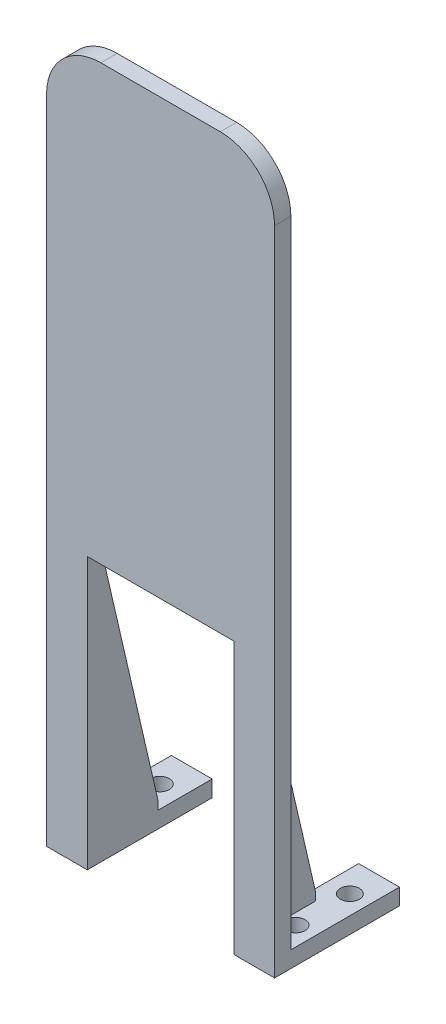
ISO-10303-21;
HEADER;
FILE_DESCRIPTION(('STEP AP214'),'2;1');
FILE_NAME('part.step','',(''),(''),'','','');
FILE_SCHEMA(('AUTOMOTIVE_DESIGN { 1 0 10303 214 1 1 1 1 }'));
ENDSEC;
DATA;
#1=APPLICATION_CONTEXT('core data for automotive mechanical design processes');
#2=APPLICATION_PROTOCOL_DEFINITION('international standard','automotive_design',2000,#1);
#3=PRODUCT_CONTEXT('',#1,'mechanical');
#4=PRODUCT('Part','Part','',(#3));
#5=PRODUCT_RELATED_PRODUCT_CATEGORY('part','',(#4));
#6=PRODUCT_DEFINITION_FORMATION('','',#4);
#7=PRODUCT_DEFINITION_CONTEXT('part definition',#1,'design');
#8=PRODUCT_DEFINITION('design','',#6,#7);
#9=PRODUCT_DEFINITION_SHAPE('','',#8);
#10=(LENGTH_UNIT() NAMED_UNIT(*) SI_UNIT(.MILLI.,.METRE.));
#11=(NAMED_UNIT(*) PLANE_ANGLE_UNIT() SI_UNIT($,.RADIAN.));
#12=(NAMED_UNIT(*) SI_UNIT($,.STERADIAN.) SOLID_ANGLE_UNIT());
#13=UNCERTAINTY_MEASURE_WITH_UNIT(LENGTH_MEASURE(1.E-05),#10,'distance_accuracy_value','');
#14=(GEOMETRIC_REPRESENTATION_CONTEXT(3) GLOBAL_UNCERTAINTY_ASSIGNED_CONTEXT((#13)) GLOBAL_UNIT_ASSIGNED_CONTEXT((#10,
#11,#12)) REPRESENTATION_CONTEXT('',''));
#15=CARTESIAN_POINT('',(0.,0.,0.));
#16=DIRECTION('',(0.,0.,1.));
#17=DIRECTION('',(1.,0.,0.));
#18=AXIS2_PLACEMENT_3D('',#15,#16,#17);
#19=CARTESIAN_POINT('',(0.,0.,-10.));
#20=DIRECTION('',(0.,0.,1.));
#21=DIRECTION('',(1.,0.,0.));
#22=AXIS2_PLACEMENT_3D('',#19,#20,#21);
#23=PLANE('',#22);
#24=DIRECTION('',(1.,0.,0.));
#25=VECTOR('',#24,1.);
#26=CARTESIAN_POINT('',(13.5,-62.,-10.));
#27=LINE('',#26,#25);
#28=CARTESIAN_POINT('',(13.5,-62.,-10.));
#29=VERTEX_POINT('',#28);
#30=CARTESIAN_POINT('',(15.5,-62.,-10.));
#31=VERTEX_POINT('',#30);
#32=EDGE_CURVE('E215',#29,#31,#27,.T.);
#33=ORIENTED_EDGE('',*,*,#32,.F.);
#34=DIRECTION('',(0.,1.,0.));
#35=VECTOR('',#34,1.);
#36=CARTESIAN_POINT('',(13.5,-65.,-10.));
#37=LINE('',#36,#35);
#38=CARTESIAN_POINT('',(13.5,-60.3147587428414,-10.));
#39=VERTEX_POINT('',#38);
#40=EDGE_CURVE('E288',#29,#39,#37,.T.);
#41=ORIENTED_EDGE('',*,*,#40,.T.);
#42=DIRECTION('',(1.,0.,0.));
#43=VECTOR('',#42,1.);
#44=CARTESIAN_POINT('',(0.,-60.3147587428414,-10.));
#45=LINE('',#44,#43);
#46=CARTESIAN_POINT('',(15.5,-60.3147587428414,-10.));
#47=VERTEX_POINT('',#46);
#48=EDGE_CURVE('E381',#39,#47,#45,.T.);
#49=ORIENTED_EDGE('',*,*,#48,.T.);
#50=DIRECTION('',(0.,-1.,0.));
#51=VECTOR('',#50,1.);
#52=CARTESIAN_POINT('',(15.5,-62.,-10.));
#53=LINE('',#52,#51);
#54=EDGE_CURVE('E291',#47,#31,#53,.T.);
#55=ORIENTED_EDGE('',*,*,#54,.T.);
#56=EDGE_LOOP('',(#33,#41,#49,#55));
#57=FACE_BOUND('',#56,.T.);
#58=ADVANCED_FACE('F45',(#57),#23,.F.);
#59=CARTESIAN_POINT('',(0.,0.,-10.));
#60=DIRECTION('',(0.,0.,1.));
#61=DIRECTION('',(1.,0.,0.));
#62=AXIS2_PLACEMENT_3D('',#59,#60,#61);
#63=PLANE('',#62);
#64=DIRECTION('',(1.,0.,0.));
#65=VECTOR('',#64,1.);
#66=CARTESIAN_POINT('',(-21.,-62.,-10.));
#67=LINE('',#66,#65);
#68=CARTESIAN_POINT('',(-15.5,-62.,-10.));
#69=VERTEX_POINT('',#68);
#70=CARTESIAN_POINT('',(-13.5,-62.,-10.));
#71=VERTEX_POINT('',#70);
#72=EDGE_CURVE('E241',#69,#71,#67,.T.);
#73=ORIENTED_EDGE('',*,*,#72,.F.);
#74=DIRECTION('',(0.,1.,0.));
#75=VECTOR('',#74,1.);
#76=CARTESIAN_POINT('',(-15.5,-62.,-10.));
#77=LINE('',#76,#75);
#78=CARTESIAN_POINT('',(-15.5,-60.3147587428414,-10.));
#79=VERTEX_POINT('',#78);
#80=EDGE_CURVE('E268',#69,#79,#77,.T.);
#81=ORIENTED_EDGE('',*,*,#80,.T.);
#82=DIRECTION('',(1.,0.,0.));
#83=VECTOR('',#82,1.);
#84=CARTESIAN_POINT('',(0.,-60.3147587428414,-10.));
#85=LINE('',#84,#83);
#86=CARTESIAN_POINT('',(-13.5,-60.3147587428414,-10.));
#87=VERTEX_POINT('',#86);
#88=EDGE_CURVE('E371',#79,#87,#85,.T.);
#89=ORIENTED_EDGE('',*,*,#88,.T.);
#90=DIRECTION('',(0.,-1.,0.));
#91=VECTOR('',#90,1.);
#92=CARTESIAN_POINT('',(-13.5,-65.,-10.));
#93=LINE('',#92,#91);
#94=EDGE_CURVE('E274',#87,#71,#93,.T.);
#95=ORIENTED_EDGE('',*,*,#94,.T.);
#96=EDGE_LOOP('',(#73,#81,#89,#95));
#97=FACE_BOUND('',#96,.T.);
#98=ADVANCED_FACE('F473',(#97),#63,.F.);
#99=CARTESIAN_POINT('',(0.,0.,0.));
#100=DIRECTION('',(0.,0.,1.));
#101=DIRECTION('',(1.,0.,0.));
#102=AXIS2_PLACEMENT_3D('',#99,#100,#101);
#103=PLANE('',#102);
#104=DIRECTION('',(0.,-1.,0.));
#105=VECTOR('',#104,1.);
#106=CARTESIAN_POINT('',(-21.,65.,0.));
#107=LINE('',#106,#105);
#108=CARTESIAN_POINT('',(-21.,55.,0.));
#109=VERTEX_POINT('',#108);
#110=CARTESIAN_POINT('',(-21.,-62.,0.));
#111=VERTEX_POINT('',#110);
#112=EDGE_CURVE('E345',#109,#111,#107,.T.);
#113=ORIENTED_EDGE('',*,*,#112,.F.);
#114=CARTESIAN_POINT('',(-11.,55.,0.));
#115=DIRECTION('',(0.,0.,1.));
#116=DIRECTION('',(1.,0.,0.));
#117=AXIS2_PLACEMENT_3D('',#114,#115,#116);
#118=CIRCLE('',#117,10.);
#119=CARTESIAN_POINT('',(-11.,65.,0.));
#120=VERTEX_POINT('',#119);
#121=EDGE_CURVE('E412',#109,#120,#118,.F.);
#122=ORIENTED_EDGE('',*,*,#121,.T.);
#123=DIRECTION('',(-1.,0.,0.));
#124=VECTOR('',#123,1.);
#125=CARTESIAN_POINT('',(-21.,65.,0.));
#126=LINE('',#125,#124);
#127=CARTESIAN_POINT('',(11.,65.,0.));
#128=VERTEX_POINT('',#127);
#129=EDGE_CURVE('E358',#128,#120,#126,.T.);
#130=ORIENTED_EDGE('',*,*,#129,.F.);
#131=CARTESIAN_POINT('',(11.,55.,0.));
#132=DIRECTION('',(0.,0.,1.));
#133=DIRECTION('',(1.,0.,0.));
#134=AXIS2_PLACEMENT_3D('',#131,#132,#133);
#135=CIRCLE('',#134,10.);
#136=CARTESIAN_POINT('',(21.,55.,0.));
#137=VERTEX_POINT('',#136);
#138=EDGE_CURVE('E409',#128,#137,#135,.F.);
#139=ORIENTED_EDGE('',*,*,#138,.T.);
#140=DIRECTION('',(0.,1.,0.));
#141=VECTOR('',#140,1.);
#142=CARTESIAN_POINT('',(21.,65.,0.));
#143=LINE('',#142,#141);
#144=CARTESIAN_POINT('',(21.,-62.,0.));
#145=VERTEX_POINT('',#144);
#146=EDGE_CURVE('E195',#145,#137,#143,.T.);
#147=ORIENTED_EDGE('',*,*,#146,.F.);
#148=DIRECTION('',(1.,0.,0.));
#149=VECTOR('',#148,1.);
#150=CARTESIAN_POINT('',(21.,-62.,0.));
#151=LINE('',#150,#149);
#152=CARTESIAN_POINT('',(15.5,-62.,0.));
#153=VERTEX_POINT('',#152);
#154=EDGE_CURVE('E292',#153,#145,#151,.T.);
#155=ORIENTED_EDGE('',*,*,#154,.F.);
#156=DIRECTION('',(0.,-1.,0.));
#157=VECTOR('',#156,1.);
#158=CARTESIAN_POINT('',(15.5,-62.,0.));
#159=LINE('',#158,#157);
#160=CARTESIAN_POINT('',(15.5,-17.,0.));
#161=VERTEX_POINT('',#160);
#162=EDGE_CURVE('E299',#161,#153,#159,.T.);
#163=ORIENTED_EDGE('',*,*,#162,.F.);
#164=DIRECTION('',(1.,0.,0.));
#165=VECTOR('',#164,1.);
#166=CARTESIAN_POINT('',(13.5,-17.,0.));
#167=LINE('',#166,#165);
#168=CARTESIAN_POINT('',(13.5,-17.,0.));
#169=VERTEX_POINT('',#168);
#170=EDGE_CURVE('E282',#169,#161,#167,.T.);
#171=ORIENTED_EDGE('',*,*,#170,.F.);
#172=DIRECTION('',(0.,1.,0.));
#173=VECTOR('',#172,1.);
#174=CARTESIAN_POINT('',(13.5,0.,0.));
#175=LINE('',#174,#173);
#176=CARTESIAN_POINT('',(13.5,-15.,0.));
#177=VERTEX_POINT('',#176);
#178=EDGE_CURVE('E368',#169,#177,#175,.T.);
#179=ORIENTED_EDGE('',*,*,#178,.T.);
#180=DIRECTION('',(-1.,0.,0.));
#181=VECTOR('',#180,1.);
#182=CARTESIAN_POINT('',(-13.5,-15.,0.));
#183=LINE('',#182,#181);
#184=CARTESIAN_POINT('',(-13.5,-15.,0.));
#185=VERTEX_POINT('',#184);
#186=EDGE_CURVE('E314',#177,#185,#183,.T.);
#187=ORIENTED_EDGE('',*,*,#186,.T.);
#188=DIRECTION('',(0.,-1.,0.));
#189=VECTOR('',#188,1.);
#190=CARTESIAN_POINT('',(-13.5,-115.,0.));
#191=LINE('',#190,#189);
#192=CARTESIAN_POINT('',(-13.5,-17.,0.));
#193=VERTEX_POINT('',#192);
#194=EDGE_CURVE('E318',#185,#193,#191,.T.);
#195=ORIENTED_EDGE('',*,*,#194,.T.);
#196=DIRECTION('',(1.,0.,0.));
#197=VECTOR('',#196,1.);
#198=CARTESIAN_POINT('',(-13.5,-17.,0.));
#199=LINE('',#198,#197);
#200=CARTESIAN_POINT('',(-15.5,-17.,0.));
#201=VERTEX_POINT('',#200);
#202=EDGE_CURVE('E269',#201,#193,#199,.T.);
#203=ORIENTED_EDGE('',*,*,#202,.F.);
#204=DIRECTION('',(0.,1.,0.));
#205=VECTOR('',#204,1.);
#206=CARTESIAN_POINT('',(-15.5,-62.,0.));
#207=LINE('',#206,#205);
#208=CARTESIAN_POINT('',(-15.5,-62.,0.));
#209=VERTEX_POINT('',#208);
#210=EDGE_CURVE('E273',#209,#201,#207,.T.);
#211=ORIENTED_EDGE('',*,*,#210,.F.);
#212=DIRECTION('',(1.,0.,0.));
#213=VECTOR('',#212,1.);
#214=CARTESIAN_POINT('',(-15.5,-62.,0.));
#215=LINE('',#214,#213);
#216=EDGE_CURVE('E278',#111,#209,#215,.T.);
#217=ORIENTED_EDGE('',*,*,#216,.F.);
#218=EDGE_LOOP('',(#113,#122,#130,#139,#147,#155,#163,#171,#179,#187,#195,#203,#211,#217));
#219=FACE_BOUND('',#218,.T.);
#220=ADVANCED_FACE('F439',(#219),#103,.F.);
#221=CARTESIAN_POINT('',(-21.,-65.,3.));
#222=DIRECTION('',(0.,1.,0.));
#223=DIRECTION('',(0.,0.,1.));
#224=AXIS2_PLACEMENT_3D('',#221,#222,#223);
#225=PLANE('',#224);
#226=CARTESIAN_POINT('',(17.5,-65.,-14.3685969401071));
#227=DIRECTION('',(0.,-1.,0.));
#228=DIRECTION('',(0.,0.,-1.));
#229=AXIS2_PLACEMENT_3D('',#226,#227,#228);
#230=CIRCLE('',#229,1.75);
#231=CARTESIAN_POINT('',(17.5,-65.,-16.1185969401071));
#232=VERTEX_POINT('',#231);
#233=EDGE_CURVE('E827',#232,#232,#230,.T.);
#234=ORIENTED_EDGE('',*,*,#233,.F.);
#235=EDGE_LOOP('',(#234));
#236=FACE_BOUND('',#235,.T.);
#237=CARTESIAN_POINT('',(17.5,-65.,-4.36859694010711));
#238=DIRECTION('',(0.,-1.,0.));
#239=DIRECTION('',(0.,0.,-1.));
#240=AXIS2_PLACEMENT_3D('',#237,#238,#239);
#241=CIRCLE('',#240,1.75);
#242=CARTESIAN_POINT('',(17.5,-65.,-6.11859694010711));
#243=VERTEX_POINT('',#242);
#244=EDGE_CURVE('E250',#243,#243,#241,.T.);
#245=ORIENTED_EDGE('',*,*,#244,.F.);
#246=EDGE_LOOP('',(#245));
#247=FACE_BOUND('',#246,.T.);
#248=DIRECTION('',(1.,0.,0.));
#249=VECTOR('',#248,1.);
#250=CARTESIAN_POINT('',(-21.,-65.,3.));
#251=LINE('',#250,#249);
#252=CARTESIAN_POINT('',(13.5,-65.,3.));
#253=VERTEX_POINT('',#252);
#254=CARTESIAN_POINT('',(21.,-65.,3.));
#255=VERTEX_POINT('',#254);
#256=EDGE_CURVE('E190',#253,#255,#251,.T.);
#257=ORIENTED_EDGE('',*,*,#256,.F.);
#258=DIRECTION('',(0.,0.,-1.));
#259=VECTOR('',#258,1.);
#260=CARTESIAN_POINT('',(13.5,-65.,3.));
#261=LINE('',#260,#259);
#262=CARTESIAN_POINT('',(13.5,-65.,-20.));
#263=VERTEX_POINT('',#262);
#264=EDGE_CURVE('E185',#253,#263,#261,.T.);
#265=ORIENTED_EDGE('',*,*,#264,.T.);
#266=DIRECTION('',(-1.,0.,0.));
#267=VECTOR('',#266,1.);
#268=CARTESIAN_POINT('',(13.5,-65.,-20.));
#269=LINE('',#268,#267);
#270=CARTESIAN_POINT('',(21.,-65.,-20.));
#271=VERTEX_POINT('',#270);
#272=EDGE_CURVE('E189',#271,#263,#269,.T.);
#273=ORIENTED_EDGE('',*,*,#272,.F.);
#274=DIRECTION('',(0.,0.,-1.));
#275=VECTOR('',#274,1.);
#276=CARTESIAN_POINT('',(21.,-65.,3.));
#277=LINE('',#276,#275);
#278=EDGE_CURVE('E355',#255,#271,#277,.T.);
#279=ORIENTED_EDGE('',*,*,#278,.F.);
#280=EDGE_LOOP('',(#257,#265,#273,#279));
#281=FACE_BOUND('',#280,.T.);
#282=ADVANCED_FACE('F187',(#236,#247,#281),#225,.F.);
#283=CARTESIAN_POINT('',(21.,65.,3.));
#284=DIRECTION('',(-1.,0.,0.));
#285=DIRECTION('',(0.,-1.,0.));
#286=AXIS2_PLACEMENT_3D('',#283,#284,#285);
#287=PLANE('',#286);
#288=ORIENTED_EDGE('',*,*,#146,.T.);
#289=DIRECTION('',(0.,0.,-1.));
#290=VECTOR('',#289,1.);
#291=CARTESIAN_POINT('',(21.,55.,3.));
#292=LINE('',#291,#290);
#293=CARTESIAN_POINT('',(21.,55.,3.));
#294=VERTEX_POINT('',#293);
#295=EDGE_CURVE('E11',#137,#294,#292,.F.);
#296=ORIENTED_EDGE('',*,*,#295,.T.);
#297=DIRECTION('',(0.,1.,0.));
#298=VECTOR('',#297,1.);
#299=CARTESIAN_POINT('',(21.,65.,3.));
#300=LINE('',#299,#298);
#301=EDGE_CURVE('E341',#255,#294,#300,.T.);
#302=ORIENTED_EDGE('',*,*,#301,.F.);
#303=ORIENTED_EDGE('',*,*,#278,.T.);
#304=DIRECTION('',(0.,-1.,0.));
#305=VECTOR('',#304,1.);
#306=CARTESIAN_POINT('',(21.,-62.,-20.));
#307=LINE('',#306,#305);
#308=CARTESIAN_POINT('',(21.,-62.,-20.));
#309=VERTEX_POINT('',#308);
#310=EDGE_CURVE('E206',#309,#271,#307,.T.);
#311=ORIENTED_EDGE('',*,*,#310,.F.);
#312=DIRECTION('',(0.,0.,1.));
#313=VECTOR('',#312,1.);
#314=CARTESIAN_POINT('',(21.,-62.,-10.));
#315=LINE('',#314,#313);
#316=EDGE_CURVE('E295',#309,#145,#315,.T.);
#317=ORIENTED_EDGE('',*,*,#316,.T.);
#318=EDGE_LOOP('',(#288,#296,#302,#303,#311,#317));
#319=FACE_BOUND('',#318,.T.);
#320=ADVANCED_FACE('F445',(#319),#287,.F.);
#321=CARTESIAN_POINT('',(-21.,65.,3.));
#322=DIRECTION('',(0.,-1.,0.));
#323=DIRECTION('',(0.,0.,-1.));
#324=AXIS2_PLACEMENT_3D('',#321,#322,#323);
#325=PLANE('',#324);
#326=ORIENTED_EDGE('',*,*,#129,.T.);
#327=DIRECTION('',(0.,0.,-1.));
#328=VECTOR('',#327,1.);
#329=CARTESIAN_POINT('',(-11.,65.,3.));
#330=LINE('',#329,#328);
#331=CARTESIAN_POINT('',(-11.,65.,3.));
#332=VERTEX_POINT('',#331);
#333=EDGE_CURVE('E67',#120,#332,#330,.F.);
#334=ORIENTED_EDGE('',*,*,#333,.T.);
#335=DIRECTION('',(-1.,0.,0.));
#336=VECTOR('',#335,1.);
#337=CARTESIAN_POINT('',(-21.,65.,3.));
#338=LINE('',#337,#336);
#339=CARTESIAN_POINT('',(11.,65.,3.));
#340=VERTEX_POINT('',#339);
#341=EDGE_CURVE('E344',#340,#332,#338,.T.);
#342=ORIENTED_EDGE('',*,*,#341,.F.);
#343=DIRECTION('',(0.,0.,-1.));
#344=VECTOR('',#343,1.);
#345=CARTESIAN_POINT('',(11.,65.,3.));
#346=LINE('',#345,#344);
#347=EDGE_CURVE('E415',#340,#128,#346,.T.);
#348=ORIENTED_EDGE('',*,*,#347,.T.);
#349=EDGE_LOOP('',(#326,#334,#342,#348));
#350=FACE_BOUND('',#349,.T.);
#351=ADVANCED_FACE('F441',(#350),#325,.F.);
#352=CARTESIAN_POINT('',(-21.,65.,3.));
#353=DIRECTION('',(1.,0.,0.));
#354=DIRECTION('',(0.,1.,0.));
#355=AXIS2_PLACEMENT_3D('',#352,#353,#354);
#356=PLANE('',#355);
#357=DIRECTION('',(0.,-1.,0.));
#358=VECTOR('',#357,1.);
#359=CARTESIAN_POINT('',(-21.,65.,3.));
#360=LINE('',#359,#358);
#361=CARTESIAN_POINT('',(-21.,55.,3.));
#362=VERTEX_POINT('',#361);
#363=CARTESIAN_POINT('',(-21.,-65.,3.));
#364=VERTEX_POINT('',#363);
#365=EDGE_CURVE('E348',#362,#364,#360,.T.);
#366=ORIENTED_EDGE('',*,*,#365,.F.);
#367=DIRECTION('',(0.,0.,-1.));
#368=VECTOR('',#367,1.);
#369=CARTESIAN_POINT('',(-21.,55.,3.));
#370=LINE('',#369,#368);
#371=EDGE_CURVE('E245',#362,#109,#370,.T.);
#372=ORIENTED_EDGE('',*,*,#371,.T.);
#373=ORIENTED_EDGE('',*,*,#112,.T.);
#374=DIRECTION('',(0.,0.,1.));
#375=VECTOR('',#374,1.);
#376=CARTESIAN_POINT('',(-21.,-62.,-10.));
#377=LINE('',#376,#375);
#378=CARTESIAN_POINT('',(-21.,-62.,-20.));
#379=VERTEX_POINT('',#378);
#380=EDGE_CURVE('E259',#379,#111,#377,.T.);
#381=ORIENTED_EDGE('',*,*,#380,.F.);
#382=DIRECTION('',(0.,1.,0.));
#383=VECTOR('',#382,1.);
#384=CARTESIAN_POINT('',(-21.,-65.,-20.));
#385=LINE('',#384,#383);
#386=CARTESIAN_POINT('',(-21.,-65.,-20.));
#387=VERTEX_POINT('',#386);
#388=EDGE_CURVE('E221',#387,#379,#385,.T.);
#389=ORIENTED_EDGE('',*,*,#388,.F.);
#390=DIRECTION('',(0.,0.,-1.));
#391=VECTOR('',#390,1.);
#392=CARTESIAN_POINT('',(-21.,-65.,3.));
#393=LINE('',#392,#391);
#394=EDGE_CURVE('E365',#364,#387,#393,.T.);
#395=ORIENTED_EDGE('',*,*,#394,.F.);
#396=EDGE_LOOP('',(#366,#372,#373,#381,#389,#395));
#397=FACE_BOUND('',#396,.T.);
#398=ADVANCED_FACE('F432',(#397),#356,.F.);
#399=CARTESIAN_POINT('',(-17.5,-65.,-14.3685969401071));
#400=DIRECTION('',(0.,-1.,0.));
#401=DIRECTION('',(0.,0.,-1.));
#402=AXIS2_PLACEMENT_3D('',#399,#400,#401);
#403=CIRCLE('',#402,1.75);
#404=CARTESIAN_POINT('',(-17.5,-65.,-16.1185969401071));
#405=VERTEX_POINT('',#404);
#406=EDGE_CURVE('E402',#405,#405,#403,.T.);
#407=ORIENTED_EDGE('',*,*,#406,.F.);
#408=EDGE_LOOP('',(#407));
#409=FACE_BOUND('',#408,.T.);
#410=CARTESIAN_POINT('',(-17.5,-65.,-4.36859694010711));
#411=DIRECTION('',(0.,-1.,0.));
#412=DIRECTION('',(0.,0.,-1.));
#413=AXIS2_PLACEMENT_3D('',#410,#411,#412);
#414=CIRCLE('',#413,1.75);
#415=CARTESIAN_POINT('',(-17.5,-65.,-6.11859694010711));
#416=VERTEX_POINT('',#415);
#417=EDGE_CURVE('E251',#416,#416,#414,.T.);
#418=ORIENTED_EDGE('',*,*,#417,.F.);
#419=EDGE_LOOP('',(#418));
#420=FACE_BOUND('',#419,.T.);
#421=ORIENTED_EDGE('',*,*,#394,.T.);
#422=DIRECTION('',(-1.,0.,0.));
#423=VECTOR('',#422,1.);
#424=CARTESIAN_POINT('',(-21.,-65.,-20.));
#425=LINE('',#424,#423);
#426=CARTESIAN_POINT('',(-13.5,-65.,-20.));
#427=VERTEX_POINT('',#426);
#428=EDGE_CURVE('E236',#427,#387,#425,.T.);
#429=ORIENTED_EDGE('',*,*,#428,.F.);
#430=DIRECTION('',(0.,0.,1.));
#431=VECTOR('',#430,1.);
#432=CARTESIAN_POINT('',(-13.5,-65.,3.));
#433=LINE('',#432,#431);
#434=CARTESIAN_POINT('',(-13.5,-65.,3.));
#435=VERTEX_POINT('',#434);
#436=EDGE_CURVE('E196',#427,#435,#433,.T.);
#437=ORIENTED_EDGE('',*,*,#436,.T.);
#438=EDGE_CURVE('E351',#364,#435,#251,.T.);
#439=ORIENTED_EDGE('',*,*,#438,.F.);
#440=EDGE_LOOP('',(#421,#429,#437,#439));
#441=FACE_BOUND('',#440,.T.);
#442=ADVANCED_FACE('F487',(#409,#420,#441),#225,.F.);
#443=CARTESIAN_POINT('',(0.,0.,3.));
#444=DIRECTION('',(0.,0.,1.));
#445=DIRECTION('',(1.,0.,0.));
#446=AXIS2_PLACEMENT_3D('',#443,#444,#445);
#447=PLANE('',#446);
#448=ORIENTED_EDGE('',*,*,#341,.T.);
#449=CARTESIAN_POINT('',(-11.,55.,3.));
#450=DIRECTION('',(0.,0.,1.));
#451=DIRECTION('',(1.,0.,0.));
#452=AXIS2_PLACEMENT_3D('',#449,#450,#451);
#453=CIRCLE('',#452,10.);
#454=EDGE_CURVE('E54',#332,#362,#453,.T.);
#455=ORIENTED_EDGE('',*,*,#454,.T.);
#456=ORIENTED_EDGE('',*,*,#365,.T.);
#457=ORIENTED_EDGE('',*,*,#438,.T.);
#458=DIRECTION('',(0.,-1.,0.));
#459=VECTOR('',#458,1.);
#460=CARTESIAN_POINT('',(-13.5,-115.,3.));
#461=LINE('',#460,#459);
#462=CARTESIAN_POINT('',(-13.5,-15.,3.));
#463=VERTEX_POINT('',#462);
#464=EDGE_CURVE('E319',#463,#435,#461,.T.);
#465=ORIENTED_EDGE('',*,*,#464,.F.);
#466=DIRECTION('',(-1.,0.,0.));
#467=VECTOR('',#466,1.);
#468=CARTESIAN_POINT('',(-13.5,-15.,3.));
#469=LINE('',#468,#467);
#470=CARTESIAN_POINT('',(13.5,-15.,3.));
#471=VERTEX_POINT('',#470);
#472=EDGE_CURVE('E326',#471,#463,#469,.T.);
#473=ORIENTED_EDGE('',*,*,#472,.F.);
#474=DIRECTION('',(0.,1.,0.));
#475=VECTOR('',#474,1.);
#476=CARTESIAN_POINT('',(13.5,-115.,3.));
#477=LINE('',#476,#475);
#478=EDGE_CURVE('E313',#253,#471,#477,.T.);
#479=ORIENTED_EDGE('',*,*,#478,.F.);
#480=ORIENTED_EDGE('',*,*,#256,.T.);
#481=ORIENTED_EDGE('',*,*,#301,.T.);
#482=CARTESIAN_POINT('',(11.,55.,3.));
#483=DIRECTION('',(0.,0.,1.));
#484=DIRECTION('',(1.,0.,0.));
#485=AXIS2_PLACEMENT_3D('',#482,#483,#484);
#486=CIRCLE('',#485,10.);
#487=EDGE_CURVE('E421',#294,#340,#486,.T.);
#488=ORIENTED_EDGE('',*,*,#487,.T.);
#489=EDGE_LOOP('',(#448,#455,#456,#457,#465,#473,#479,#480,#481,#488));
#490=FACE_BOUND('',#489,.T.);
#491=ADVANCED_FACE('F427',(#490),#447,.T.);
#492=CARTESIAN_POINT('',(13.5,-115.,0.));
#493=DIRECTION('',(1.,0.,0.));
#494=DIRECTION('',(0.,0.,-1.));
#495=AXIS2_PLACEMENT_3D('',#492,#493,#494);
#496=PLANE('',#495);
#497=ORIENTED_EDGE('',*,*,#178,.F.);
#498=DIRECTION('',(0.,0.974370064785235,0.224951054343866));
#499=VECTOR('',#498,1.);
#500=CARTESIAN_POINT('',(13.5,-60.3147587428414,-10.));
#501=LINE('',#500,#499);
#502=EDGE_CURVE('E246',#169,#39,#501,.F.);
#503=ORIENTED_EDGE('',*,*,#502,.T.);
#504=ORIENTED_EDGE('',*,*,#40,.F.);
#505=DIRECTION('',(0.,0.,1.));
#506=VECTOR('',#505,1.);
#507=CARTESIAN_POINT('',(13.5,-62.,-20.));
#508=LINE('',#507,#506);
#509=CARTESIAN_POINT('',(13.5,-62.,-20.));
#510=VERTEX_POINT('',#509);
#511=EDGE_CURVE('E208',#510,#29,#508,.T.);
#512=ORIENTED_EDGE('',*,*,#511,.F.);
#513=DIRECTION('',(0.,1.,0.));
#514=VECTOR('',#513,1.);
#515=CARTESIAN_POINT('',(13.5,-62.,-20.));
#516=LINE('',#515,#514);
#517=EDGE_CURVE('E203',#263,#510,#516,.T.);
#518=ORIENTED_EDGE('',*,*,#517,.F.);
#519=ORIENTED_EDGE('',*,*,#264,.F.);
#520=ORIENTED_EDGE('',*,*,#478,.T.);
#521=DIRECTION('',(0.,0.,1.));
#522=VECTOR('',#521,1.);
#523=CARTESIAN_POINT('',(13.5,-15.,0.));
#524=LINE('',#523,#522);
#525=EDGE_CURVE('E323',#177,#471,#524,.T.);
#526=ORIENTED_EDGE('',*,*,#525,.F.);
#527=EDGE_LOOP('',(#497,#503,#504,#512,#518,#519,#520,#526));
#528=FACE_BOUND('',#527,.T.);
#529=ADVANCED_FACE('F211',(#528),#496,.F.);
#530=CARTESIAN_POINT('',(-13.5,-115.,0.));
#531=DIRECTION('',(-1.,0.,0.));
#532=DIRECTION('',(0.,0.,1.));
#533=AXIS2_PLACEMENT_3D('',#530,#531,#532);
#534=PLANE('',#533);
#535=ORIENTED_EDGE('',*,*,#94,.F.);
#536=DIRECTION('',(0.,-0.974370064785235,-0.224951054343866));
#537=VECTOR('',#536,1.);
#538=CARTESIAN_POINT('',(-13.5,-60.3147587428414,-10.));
#539=LINE('',#538,#537);
#540=EDGE_CURVE('E375',#87,#193,#539,.F.);
#541=ORIENTED_EDGE('',*,*,#540,.T.);
#542=ORIENTED_EDGE('',*,*,#194,.F.);
#543=DIRECTION('',(0.,0.,1.));
#544=VECTOR('',#543,1.);
#545=CARTESIAN_POINT('',(-13.5,-15.,0.));
#546=LINE('',#545,#544);
#547=EDGE_CURVE('E332',#185,#463,#546,.T.);
#548=ORIENTED_EDGE('',*,*,#547,.T.);
#549=ORIENTED_EDGE('',*,*,#464,.T.);
#550=ORIENTED_EDGE('',*,*,#436,.F.);
#551=DIRECTION('',(0.,-1.,0.));
#552=VECTOR('',#551,1.);
#553=CARTESIAN_POINT('',(-13.5,-65.,-20.));
#554=LINE('',#553,#552);
#555=CARTESIAN_POINT('',(-13.5,-62.,-20.));
#556=VERTEX_POINT('',#555);
#557=EDGE_CURVE('E232',#556,#427,#554,.T.);
#558=ORIENTED_EDGE('',*,*,#557,.F.);
#559=DIRECTION('',(0.,0.,1.));
#560=VECTOR('',#559,1.);
#561=CARTESIAN_POINT('',(-13.5,-62.,-20.));
#562=LINE('',#561,#560);
#563=EDGE_CURVE('E240',#556,#71,#562,.T.);
#564=ORIENTED_EDGE('',*,*,#563,.T.);
#565=EDGE_LOOP('',(#535,#541,#542,#548,#549,#550,#558,#564));
#566=FACE_BOUND('',#565,.T.);
#567=ADVANCED_FACE('F467',(#566),#534,.F.);
#568=CARTESIAN_POINT('',(-13.5,-15.,0.));
#569=DIRECTION('',(0.,1.,0.));
#570=DIRECTION('',(0.,0.,1.));
#571=AXIS2_PLACEMENT_3D('',#568,#569,#570);
#572=PLANE('',#571);
#573=ORIENTED_EDGE('',*,*,#472,.T.);
#574=ORIENTED_EDGE('',*,*,#547,.F.);
#575=ORIENTED_EDGE('',*,*,#186,.F.);
#576=ORIENTED_EDGE('',*,*,#525,.T.);
#577=EDGE_LOOP('',(#573,#574,#575,#576));
#578=FACE_BOUND('',#577,.T.);
#579=ADVANCED_FACE('F462',(#578),#572,.F.);
#580=CARTESIAN_POINT('',(15.5,-62.,-10.));
#581=DIRECTION('',(-1.,0.,0.));
#582=DIRECTION('',(0.,0.,1.));
#583=AXIS2_PLACEMENT_3D('',#580,#581,#582);
#584=PLANE('',#583);
#585=ORIENTED_EDGE('',*,*,#54,.F.);
#586=DIRECTION('',(0.,-0.974370064785235,-0.224951054343866));
#587=VECTOR('',#586,1.);
#588=CARTESIAN_POINT('',(15.5,-60.3147587428414,-10.));
#589=LINE('',#588,#587);
#590=EDGE_CURVE('E385',#47,#161,#589,.F.);
#591=ORIENTED_EDGE('',*,*,#590,.T.);
#592=ORIENTED_EDGE('',*,*,#162,.T.);
#593=DIRECTION('',(0.,0.,1.));
#594=VECTOR('',#593,1.);
#595=CARTESIAN_POINT('',(15.5,-62.,-10.));
#596=LINE('',#595,#594);
#597=EDGE_CURVE('E309',#31,#153,#596,.T.);
#598=ORIENTED_EDGE('',*,*,#597,.F.);
#599=EDGE_LOOP('',(#585,#591,#592,#598));
#600=FACE_BOUND('',#599,.T.);
#601=ADVANCED_FACE('F452',(#600),#584,.F.);
#602=CARTESIAN_POINT('',(21.,-62.,-10.));
#603=DIRECTION('',(0.,-1.,0.));
#604=DIRECTION('',(0.,0.,-1.));
#605=AXIS2_PLACEMENT_3D('',#602,#603,#604);
#606=PLANE('',#605);
#607=CARTESIAN_POINT('',(17.5,-62.,-14.3685969401071));
#608=DIRECTION('',(0.,-1.,0.));
#609=DIRECTION('',(0.,0.,-1.));
#610=AXIS2_PLACEMENT_3D('',#607,#608,#609);
#611=CIRCLE('',#610,1.75);
#612=CARTESIAN_POINT('',(17.5,-62.,-16.1185969401071));
#613=VERTEX_POINT('',#612);
#614=EDGE_CURVE('E401',#613,#613,#611,.T.);
#615=ORIENTED_EDGE('',*,*,#614,.T.);
#616=EDGE_LOOP('',(#615));
#617=FACE_BOUND('',#616,.T.);
#618=CARTESIAN_POINT('',(17.5,-62.,-4.36859694010711));
#619=DIRECTION('',(0.,-1.,0.));
#620=DIRECTION('',(0.,0.,-1.));
#621=AXIS2_PLACEMENT_3D('',#618,#619,#620);
#622=CIRCLE('',#621,1.75);
#623=CARTESIAN_POINT('',(17.5,-62.,-6.11859694010711));
#624=VERTEX_POINT('',#623);
#625=EDGE_CURVE('E264',#624,#624,#622,.T.);
#626=ORIENTED_EDGE('',*,*,#625,.T.);
#627=EDGE_LOOP('',(#626));
#628=FACE_BOUND('',#627,.T.);
#629=ORIENTED_EDGE('',*,*,#154,.T.);
#630=ORIENTED_EDGE('',*,*,#316,.F.);
#631=DIRECTION('',(1.,0.,0.));
#632=VECTOR('',#631,1.);
#633=CARTESIAN_POINT('',(13.5,-62.,-20.));
#634=LINE('',#633,#632);
#635=EDGE_CURVE('E216',#510,#309,#634,.T.);
#636=ORIENTED_EDGE('',*,*,#635,.F.);
#637=ORIENTED_EDGE('',*,*,#511,.T.);
#638=ORIENTED_EDGE('',*,*,#32,.T.);
#639=ORIENTED_EDGE('',*,*,#597,.T.);
#640=EDGE_LOOP('',(#629,#630,#636,#637,#638,#639));
#641=FACE_BOUND('',#640,.T.);
#642=ADVANCED_FACE('F447',(#617,#628,#641),#606,.F.);
#643=CARTESIAN_POINT('',(-15.5,-62.,-10.));
#644=DIRECTION('',(0.,-1.,0.));
#645=DIRECTION('',(0.,0.,-1.));
#646=AXIS2_PLACEMENT_3D('',#643,#644,#645);
#647=PLANE('',#646);
#648=CARTESIAN_POINT('',(-17.5,-62.,-14.3685969401071));
#649=DIRECTION('',(0.,-1.,0.));
#650=DIRECTION('',(0.,0.,-1.));
#651=AXIS2_PLACEMENT_3D('',#648,#649,#650);
#652=CIRCLE('',#651,1.75);
#653=CARTESIAN_POINT('',(-17.5,-62.,-16.1185969401071));
#654=VERTEX_POINT('',#653);
#655=EDGE_CURVE('E397',#654,#654,#652,.T.);
#656=ORIENTED_EDGE('',*,*,#655,.T.);
#657=EDGE_LOOP('',(#656));
#658=FACE_BOUND('',#657,.T.);
#659=CARTESIAN_POINT('',(-17.5,-62.,-4.36859694010711));
#660=DIRECTION('',(0.,-1.,0.));
#661=DIRECTION('',(0.,0.,-1.));
#662=AXIS2_PLACEMENT_3D('',#659,#660,#661);
#663=CIRCLE('',#662,1.75);
#664=CARTESIAN_POINT('',(-17.5,-62.,-6.11859694010711));
#665=VERTEX_POINT('',#664);
#666=EDGE_CURVE('E255',#665,#665,#663,.T.);
#667=ORIENTED_EDGE('',*,*,#666,.T.);
#668=EDGE_LOOP('',(#667));
#669=FACE_BOUND('',#668,.T.);
#670=ORIENTED_EDGE('',*,*,#216,.T.);
#671=DIRECTION('',(0.,0.,1.));
#672=VECTOR('',#671,1.);
#673=CARTESIAN_POINT('',(-15.5,-62.,-10.));
#674=LINE('',#673,#672);
#675=EDGE_CURVE('E263',#69,#209,#674,.T.);
#676=ORIENTED_EDGE('',*,*,#675,.F.);
#677=ORIENTED_EDGE('',*,*,#72,.T.);
#678=ORIENTED_EDGE('',*,*,#563,.F.);
#679=DIRECTION('',(1.,0.,0.));
#680=VECTOR('',#679,1.);
#681=CARTESIAN_POINT('',(-21.,-62.,-20.));
#682=LINE('',#681,#680);
#683=EDGE_CURVE('E229',#379,#556,#682,.T.);
#684=ORIENTED_EDGE('',*,*,#683,.F.);
#685=ORIENTED_EDGE('',*,*,#380,.T.);
#686=EDGE_LOOP('',(#670,#676,#677,#678,#684,#685));
#687=FACE_BOUND('',#686,.T.);
#688=ADVANCED_FACE('F479',(#658,#669,#687),#647,.F.);
#689=CARTESIAN_POINT('',(-15.5,-62.,-10.));
#690=DIRECTION('',(1.,0.,0.));
#691=DIRECTION('',(0.,0.,-1.));
#692=AXIS2_PLACEMENT_3D('',#689,#690,#691);
#693=PLANE('',#692);
#694=ORIENTED_EDGE('',*,*,#210,.T.);
#695=DIRECTION('',(0.,0.974370064785235,0.224951054343866));
#696=VECTOR('',#695,1.);
#697=CARTESIAN_POINT('',(-15.5,-60.3147587428414,-10.));
#698=LINE('',#697,#696);
#699=EDGE_CURVE('E378',#201,#79,#698,.F.);
#700=ORIENTED_EDGE('',*,*,#699,.T.);
#701=ORIENTED_EDGE('',*,*,#80,.F.);
#702=ORIENTED_EDGE('',*,*,#675,.T.);
#703=EDGE_LOOP('',(#694,#700,#701,#702));
#704=FACE_BOUND('',#703,.T.);
#705=ADVANCED_FACE('F477',(#704),#693,.F.);
#706=CARTESIAN_POINT('',(0.,-60.3147587428414,-10.));
#707=DIRECTION('',(0.,-0.224951054343866,0.974370064785235));
#708=DIRECTION('',(1.,0.,0.));
#709=AXIS2_PLACEMENT_3D('',#706,#707,#708);
#710=PLANE('',#709);
#711=ORIENTED_EDGE('',*,*,#699,.F.);
#712=ORIENTED_EDGE('',*,*,#202,.T.);
#713=ORIENTED_EDGE('',*,*,#540,.F.);
#714=ORIENTED_EDGE('',*,*,#88,.F.);
#715=EDGE_LOOP('',(#711,#712,#713,#714));
#716=FACE_BOUND('',#715,.T.);
#717=ADVANCED_FACE('F471',(#716),#710,.F.);
#718=CARTESIAN_POINT('',(0.,-60.3147587428414,-10.));
#719=DIRECTION('',(0.,-0.224951054343866,0.974370064785235));
#720=DIRECTION('',(1.,0.,0.));
#721=AXIS2_PLACEMENT_3D('',#718,#719,#720);
#722=PLANE('',#721);
#723=ORIENTED_EDGE('',*,*,#502,.F.);
#724=ORIENTED_EDGE('',*,*,#170,.T.);
#725=ORIENTED_EDGE('',*,*,#590,.F.);
#726=ORIENTED_EDGE('',*,*,#48,.F.);
#727=EDGE_LOOP('',(#723,#724,#725,#726));
#728=FACE_BOUND('',#727,.T.);
#729=ADVANCED_FACE('F456',(#728),#722,.F.);
#730=CARTESIAN_POINT('',(-17.5,-55.,-4.36859694010711));
#731=DIRECTION('',(0.,-1.,0.));
#732=DIRECTION('',(0.,0.,-1.));
#733=AXIS2_PLACEMENT_3D('',#730,#731,#732);
#734=CYLINDRICAL_SURFACE('',#733,1.75);
#735=ORIENTED_EDGE('',*,*,#417,.T.);
#736=EDGE_LOOP('',(#735));
#737=FACE_BOUND('',#736,.T.);
#738=ORIENTED_EDGE('',*,*,#666,.F.);
#739=EDGE_LOOP('',(#738));
#740=FACE_BOUND('',#739,.T.);
#741=ADVANCED_FACE('F636',(#737,#740),#734,.F.);
#742=CARTESIAN_POINT('',(17.5,-55.,-4.36859694010711));
#743=DIRECTION('',(0.,-1.,0.));
#744=DIRECTION('',(0.,0.,-1.));
#745=AXIS2_PLACEMENT_3D('',#742,#743,#744);
#746=CYLINDRICAL_SURFACE('',#745,1.75);
#747=ORIENTED_EDGE('',*,*,#244,.T.);
#748=EDGE_LOOP('',(#747));
#749=FACE_BOUND('',#748,.T.);
#750=ORIENTED_EDGE('',*,*,#625,.F.);
#751=EDGE_LOOP('',(#750));
#752=FACE_BOUND('',#751,.T.);
#753=ADVANCED_FACE('F612',(#749,#752),#746,.F.);
#754=CARTESIAN_POINT('',(0.,0.,-20.));
#755=DIRECTION('',(0.,0.,-1.));
#756=DIRECTION('',(-1.,0.,0.));
#757=AXIS2_PLACEMENT_3D('',#754,#755,#756);
#758=PLANE('',#757);
#759=ORIENTED_EDGE('',*,*,#388,.T.);
#760=ORIENTED_EDGE('',*,*,#683,.T.);
#761=ORIENTED_EDGE('',*,*,#557,.T.);
#762=ORIENTED_EDGE('',*,*,#428,.T.);
#763=EDGE_LOOP('',(#759,#760,#761,#762));
#764=FACE_BOUND('',#763,.T.);
#765=ADVANCED_FACE('F483',(#764),#758,.T.);
#766=CARTESIAN_POINT('',(0.,0.,-20.));
#767=DIRECTION('',(0.,0.,1.));
#768=DIRECTION('',(1.,0.,0.));
#769=AXIS2_PLACEMENT_3D('',#766,#767,#768);
#770=PLANE('',#769);
#771=ORIENTED_EDGE('',*,*,#517,.T.);
#772=ORIENTED_EDGE('',*,*,#635,.T.);
#773=ORIENTED_EDGE('',*,*,#310,.T.);
#774=ORIENTED_EDGE('',*,*,#272,.T.);
#775=EDGE_LOOP('',(#771,#772,#773,#774));
#776=FACE_BOUND('',#775,.T.);
#777=ADVANCED_FACE('F201',(#776),#770,.F.);
#778=CARTESIAN_POINT('',(-17.5,-55.,-14.3685969401071));
#779=DIRECTION('',(0.,-1.,0.));
#780=DIRECTION('',(0.,0.,-1.));
#781=AXIS2_PLACEMENT_3D('',#778,#779,#780);
#782=CYLINDRICAL_SURFACE('',#781,1.75);
#783=ORIENTED_EDGE('',*,*,#406,.T.);
#784=EDGE_LOOP('',(#783));
#785=FACE_BOUND('',#784,.T.);
#786=ORIENTED_EDGE('',*,*,#655,.F.);
#787=EDGE_LOOP('',(#786));
#788=FACE_BOUND('',#787,.T.);
#789=ADVANCED_FACE('F587',(#785,#788),#782,.F.);
#790=CARTESIAN_POINT('',(17.5,-55.,-14.3685969401071));
#791=DIRECTION('',(0.,-1.,0.));
#792=DIRECTION('',(0.,0.,-1.));
#793=AXIS2_PLACEMENT_3D('',#790,#791,#792);
#794=CYLINDRICAL_SURFACE('',#793,1.75);
#795=ORIENTED_EDGE('',*,*,#233,.T.);
#796=EDGE_LOOP('',(#795));
#797=FACE_BOUND('',#796,.T.);
#798=ORIENTED_EDGE('',*,*,#614,.F.);
#799=EDGE_LOOP('',(#798));
#800=FACE_BOUND('',#799,.T.);
#801=ADVANCED_FACE('F568',(#797,#800),#794,.F.);
#802=CARTESIAN_POINT('',(-11.,55.,3.));
#803=DIRECTION('',(0.,0.,-1.));
#804=DIRECTION('',(-1.,0.,0.));
#805=AXIS2_PLACEMENT_3D('',#802,#803,#804);
#806=CYLINDRICAL_SURFACE('',#805,10.);
#807=ORIENTED_EDGE('',*,*,#454,.F.);
#808=ORIENTED_EDGE('',*,*,#333,.F.);
#809=ORIENTED_EDGE('',*,*,#121,.F.);
#810=ORIENTED_EDGE('',*,*,#371,.F.);
#811=EDGE_LOOP('',(#807,#808,#809,#810));
#812=FACE_BOUND('',#811,.T.);
#813=ADVANCED_FACE('F436',(#812),#806,.T.);
#814=CARTESIAN_POINT('',(11.,55.,3.));
#815=DIRECTION('',(0.,0.,-1.));
#816=DIRECTION('',(-1.,0.,0.));
#817=AXIS2_PLACEMENT_3D('',#814,#815,#816);
#818=CYLINDRICAL_SURFACE('',#817,10.);
#819=ORIENTED_EDGE('',*,*,#487,.F.);
#820=ORIENTED_EDGE('',*,*,#295,.F.);
#821=ORIENTED_EDGE('',*,*,#138,.F.);
#822=ORIENTED_EDGE('',*,*,#347,.F.);
#823=EDGE_LOOP('',(#819,#820,#821,#822));
#824=FACE_BOUND('',#823,.T.);
#825=ADVANCED_FACE('F47',(#824),#818,.T.);
#826=CLOSED_SHELL('',(#58,#98,#220,#282,#320,#351,#398,#442,#491,#529,#567,#579,#601,#642,#688,
#705,#717,#729,#741,#753,#765,#777,#789,#801,#813,#825));
#827=MANIFOLD_SOLID_BREP('B2',#826);
#828=ADVANCED_BREP_SHAPE_REPRESENTATION('',(#18,#827),#14);
#829=SHAPE_DEFINITION_REPRESENTATION(#9,#828);
ENDSEC;
END-ISO-10303-21;
